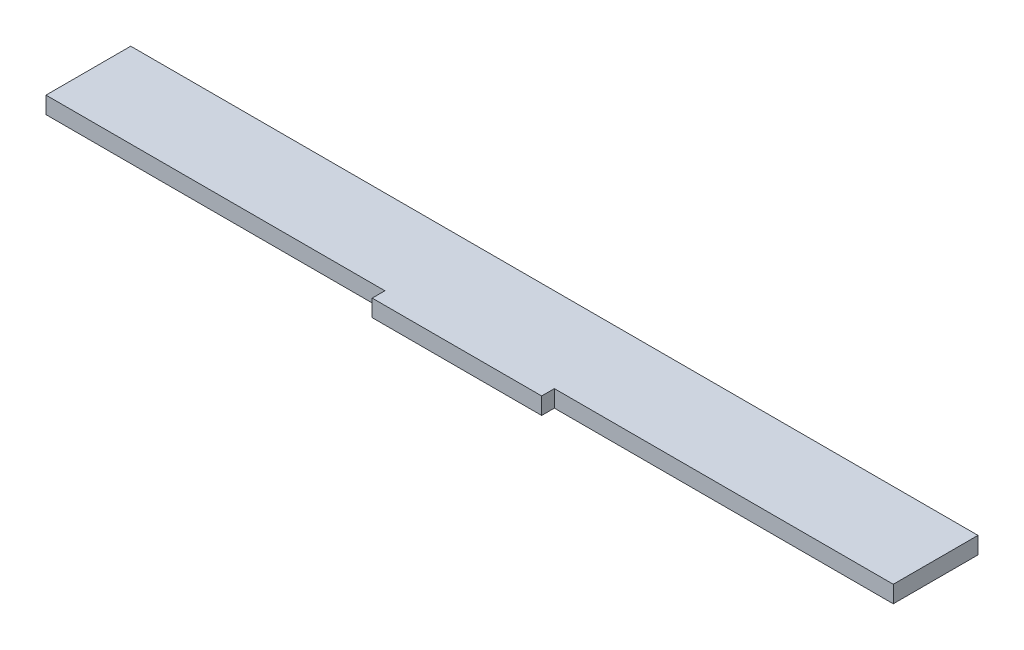
ISO-10303-21;
HEADER;
FILE_DESCRIPTION(('STEP AP214'),'2;1');
FILE_NAME('part.step','',(''),(''),'','','');
FILE_SCHEMA(('AUTOMOTIVE_DESIGN { 1 0 10303 214 1 1 1 1 }'));
ENDSEC;
DATA;
#1=APPLICATION_CONTEXT('core data for automotive mechanical design processes');
#2=APPLICATION_PROTOCOL_DEFINITION('international standard','automotive_design',2000,#1);
#3=PRODUCT_CONTEXT('',#1,'mechanical');
#4=PRODUCT('Part','Part','',(#3));
#5=PRODUCT_RELATED_PRODUCT_CATEGORY('part','',(#4));
#6=PRODUCT_DEFINITION_FORMATION('','',#4);
#7=PRODUCT_DEFINITION_CONTEXT('part definition',#1,'design');
#8=PRODUCT_DEFINITION('design','',#6,#7);
#9=PRODUCT_DEFINITION_SHAPE('','',#8);
#10=(LENGTH_UNIT() NAMED_UNIT(*) SI_UNIT(.MILLI.,.METRE.));
#11=(NAMED_UNIT(*) PLANE_ANGLE_UNIT() SI_UNIT($,.RADIAN.));
#12=(NAMED_UNIT(*) SI_UNIT($,.STERADIAN.) SOLID_ANGLE_UNIT());
#13=UNCERTAINTY_MEASURE_WITH_UNIT(LENGTH_MEASURE(1.E-05),#10,'distance_accuracy_value','');
#14=(GEOMETRIC_REPRESENTATION_CONTEXT(3) GLOBAL_UNCERTAINTY_ASSIGNED_CONTEXT((#13)) GLOBAL_UNIT_ASSIGNED_CONTEXT((#10,
#11,#12)) REPRESENTATION_CONTEXT('',''));
#15=CARTESIAN_POINT('',(0.,0.,0.));
#16=DIRECTION('',(0.,0.,1.));
#17=DIRECTION('',(1.,0.,0.));
#18=AXIS2_PLACEMENT_3D('',#15,#16,#17);
#19=CARTESIAN_POINT('',(0.,4.,-10.));
#20=DIRECTION('',(0.,0.,-1.));
#21=DIRECTION('',(-1.,0.,0.));
#22=AXIS2_PLACEMENT_3D('',#19,#20,#21);
#23=PLANE('',#22);
#24=DIRECTION('',(1.,0.,0.));
#25=VECTOR('',#24,1.);
#26=CARTESIAN_POINT('',(0.,0.,-10.));
#27=LINE('',#26,#25);
#28=CARTESIAN_POINT('',(-100.,0.,-9.99999999999999));
#29=VERTEX_POINT('',#28);
#30=CARTESIAN_POINT('',(100.,0.,-10.));
#31=VERTEX_POINT('',#30);
#32=EDGE_CURVE('E157',#29,#31,#27,.T.);
#33=ORIENTED_EDGE('',*,*,#32,.F.);
#34=DIRECTION('',(0.,-1.,0.));
#35=VECTOR('',#34,1.);
#36=CARTESIAN_POINT('',(-100.,4.,-9.99999999999999));
#37=LINE('',#36,#35);
#38=CARTESIAN_POINT('',(-100.,4.,-9.99999999999999));
#39=VERTEX_POINT('',#38);
#40=EDGE_CURVE('E134',#39,#29,#37,.T.);
#41=ORIENTED_EDGE('',*,*,#40,.F.);
#42=DIRECTION('',(1.,0.,0.));
#43=VECTOR('',#42,1.);
#44=CARTESIAN_POINT('',(0.,4.,-10.));
#45=LINE('',#44,#43);
#46=CARTESIAN_POINT('',(100.,4.,-10.));
#47=VERTEX_POINT('',#46);
#48=EDGE_CURVE('E200',#39,#47,#45,.T.);
#49=ORIENTED_EDGE('',*,*,#48,.T.);
#50=DIRECTION('',(0.,-1.,0.));
#51=VECTOR('',#50,1.);
#52=CARTESIAN_POINT('',(100.,4.,-10.));
#53=LINE('',#52,#51);
#54=EDGE_CURVE('E127',#47,#31,#53,.T.);
#55=ORIENTED_EDGE('',*,*,#54,.T.);
#56=EDGE_LOOP('',(#33,#41,#49,#55));
#57=FACE_BOUND('',#56,.T.);
#58=ADVANCED_FACE('F59',(#57),#23,.T.);
#59=CARTESIAN_POINT('',(-100.,4.,0.));
#60=DIRECTION('',(-1.,0.,0.));
#61=DIRECTION('',(0.,0.,1.));
#62=AXIS2_PLACEMENT_3D('',#59,#60,#61);
#63=PLANE('',#62);
#64=DIRECTION('',(0.,0.,-1.));
#65=VECTOR('',#64,1.);
#66=CARTESIAN_POINT('',(-100.,0.,0.));
#67=LINE('',#66,#65);
#68=CARTESIAN_POINT('',(-100.,0.,10.));
#69=VERTEX_POINT('',#68);
#70=EDGE_CURVE('E165',#69,#29,#67,.T.);
#71=ORIENTED_EDGE('',*,*,#70,.F.);
#72=DIRECTION('',(0.,-1.,0.));
#73=VECTOR('',#72,1.);
#74=CARTESIAN_POINT('',(-100.,4.,10.));
#75=LINE('',#74,#73);
#76=CARTESIAN_POINT('',(-100.,4.,10.));
#77=VERTEX_POINT('',#76);
#78=EDGE_CURVE('E154',#77,#69,#75,.T.);
#79=ORIENTED_EDGE('',*,*,#78,.F.);
#80=DIRECTION('',(0.,0.,-1.));
#81=VECTOR('',#80,1.);
#82=CARTESIAN_POINT('',(-100.,4.,0.));
#83=LINE('',#82,#81);
#84=EDGE_CURVE('E160',#77,#39,#83,.T.);
#85=ORIENTED_EDGE('',*,*,#84,.T.);
#86=ORIENTED_EDGE('',*,*,#40,.T.);
#87=EDGE_LOOP('',(#71,#79,#85,#86));
#88=FACE_BOUND('',#87,.T.);
#89=ADVANCED_FACE('F174',(#88),#63,.T.);
#90=CARTESIAN_POINT('',(100.,4.,0.));
#91=DIRECTION('',(-1.,0.,0.));
#92=DIRECTION('',(0.,0.,1.));
#93=AXIS2_PLACEMENT_3D('',#90,#91,#92);
#94=PLANE('',#93);
#95=DIRECTION('',(0.,0.,-1.));
#96=VECTOR('',#95,1.);
#97=CARTESIAN_POINT('',(100.,0.,0.));
#98=LINE('',#97,#96);
#99=CARTESIAN_POINT('',(100.,0.,9.99999999999998));
#100=VERTEX_POINT('',#99);
#101=EDGE_CURVE('E155',#100,#31,#98,.T.);
#102=ORIENTED_EDGE('',*,*,#101,.T.);
#103=ORIENTED_EDGE('',*,*,#54,.F.);
#104=DIRECTION('',(0.,0.,-1.));
#105=VECTOR('',#104,1.);
#106=CARTESIAN_POINT('',(100.,4.,0.));
#107=LINE('',#106,#105);
#108=CARTESIAN_POINT('',(100.,4.,9.99999999999998));
#109=VERTEX_POINT('',#108);
#110=EDGE_CURVE('E197',#109,#47,#107,.T.);
#111=ORIENTED_EDGE('',*,*,#110,.F.);
#112=DIRECTION('',(0.,-1.,0.));
#113=VECTOR('',#112,1.);
#114=CARTESIAN_POINT('',(100.,4.,9.99999999999998));
#115=LINE('',#114,#113);
#116=EDGE_CURVE('E123',#109,#100,#115,.T.);
#117=ORIENTED_EDGE('',*,*,#116,.T.);
#118=EDGE_LOOP('',(#102,#103,#111,#117));
#119=FACE_BOUND('',#118,.T.);
#120=ADVANCED_FACE('F202',(#119),#94,.F.);
#121=CARTESIAN_POINT('',(0.,0.,0.));
#122=DIRECTION('',(0.,1.,0.));
#123=DIRECTION('',(0.,0.,1.));
#124=AXIS2_PLACEMENT_3D('',#121,#122,#123);
#125=PLANE('',#124);
#126=DIRECTION('',(1.,0.,0.));
#127=VECTOR('',#126,1.);
#128=CARTESIAN_POINT('',(0.,0.,9.99999999999999));
#129=LINE('',#128,#127);
#130=CARTESIAN_POINT('',(-20.,0.,10.));
#131=VERTEX_POINT('',#130);
#132=EDGE_CURVE('E145',#69,#131,#129,.T.);
#133=ORIENTED_EDGE('',*,*,#132,.F.);
#134=ORIENTED_EDGE('',*,*,#70,.T.);
#135=ORIENTED_EDGE('',*,*,#32,.T.);
#136=ORIENTED_EDGE('',*,*,#101,.F.);
#137=CARTESIAN_POINT('',(20.,0.,9.99999999999999));
#138=VERTEX_POINT('',#137);
#139=EDGE_CURVE('E115',#138,#100,#129,.T.);
#140=ORIENTED_EDGE('',*,*,#139,.F.);
#141=DIRECTION('',(0.,0.,1.));
#142=VECTOR('',#141,1.);
#143=CARTESIAN_POINT('',(20.,0.,9.99999999999999));
#144=LINE('',#143,#142);
#145=CARTESIAN_POINT('',(20.,0.,13.));
#146=VERTEX_POINT('',#145);
#147=EDGE_CURVE('E102',#138,#146,#144,.T.);
#148=ORIENTED_EDGE('',*,*,#147,.T.);
#149=DIRECTION('',(1.,0.,0.));
#150=VECTOR('',#149,1.);
#151=CARTESIAN_POINT('',(-20.,0.,13.));
#152=LINE('',#151,#150);
#153=CARTESIAN_POINT('',(-20.,0.,13.));
#154=VERTEX_POINT('',#153);
#155=EDGE_CURVE('E96',#154,#146,#152,.T.);
#156=ORIENTED_EDGE('',*,*,#155,.F.);
#157=DIRECTION('',(0.,0.,1.));
#158=VECTOR('',#157,1.);
#159=CARTESIAN_POINT('',(-20.,0.,10.));
#160=LINE('',#159,#158);
#161=EDGE_CURVE('E109',#131,#154,#160,.T.);
#162=ORIENTED_EDGE('',*,*,#161,.F.);
#163=EDGE_LOOP('',(#133,#134,#135,#136,#140,#148,#156,#162));
#164=FACE_BOUND('',#163,.T.);
#165=ADVANCED_FACE('F112',(#164),#125,.F.);
#166=CARTESIAN_POINT('',(0.,4.,0.));
#167=DIRECTION('',(0.,1.,0.));
#168=DIRECTION('',(0.,0.,1.));
#169=AXIS2_PLACEMENT_3D('',#166,#167,#168);
#170=PLANE('',#169);
#171=DIRECTION('',(1.,0.,0.));
#172=VECTOR('',#171,1.);
#173=CARTESIAN_POINT('',(0.,4.,9.99999999999999));
#174=LINE('',#173,#172);
#175=CARTESIAN_POINT('',(-20.,4.,10.));
#176=VERTEX_POINT('',#175);
#177=EDGE_CURVE('E196',#77,#176,#174,.T.);
#178=ORIENTED_EDGE('',*,*,#177,.T.);
#179=DIRECTION('',(0.,0.,1.));
#180=VECTOR('',#179,1.);
#181=CARTESIAN_POINT('',(-20.,4.,10.));
#182=LINE('',#181,#180);
#183=CARTESIAN_POINT('',(-20.,4.,13.));
#184=VERTEX_POINT('',#183);
#185=EDGE_CURVE('E116',#176,#184,#182,.T.);
#186=ORIENTED_EDGE('',*,*,#185,.T.);
#187=DIRECTION('',(1.,0.,0.));
#188=VECTOR('',#187,1.);
#189=CARTESIAN_POINT('',(-20.,4.,13.));
#190=LINE('',#189,#188);
#191=CARTESIAN_POINT('',(20.,4.,13.));
#192=VERTEX_POINT('',#191);
#193=EDGE_CURVE('E119',#184,#192,#190,.T.);
#194=ORIENTED_EDGE('',*,*,#193,.T.);
#195=DIRECTION('',(0.,0.,1.));
#196=VECTOR('',#195,1.);
#197=CARTESIAN_POINT('',(20.,4.,9.99999999999999));
#198=LINE('',#197,#196);
#199=CARTESIAN_POINT('',(20.,4.,9.99999999999999));
#200=VERTEX_POINT('',#199);
#201=EDGE_CURVE('E104',#200,#192,#198,.T.);
#202=ORIENTED_EDGE('',*,*,#201,.F.);
#203=EDGE_CURVE('E167',#200,#109,#174,.T.);
#204=ORIENTED_EDGE('',*,*,#203,.T.);
#205=ORIENTED_EDGE('',*,*,#110,.T.);
#206=ORIENTED_EDGE('',*,*,#48,.F.);
#207=ORIENTED_EDGE('',*,*,#84,.F.);
#208=EDGE_LOOP('',(#178,#186,#194,#202,#204,#205,#206,#207));
#209=FACE_BOUND('',#208,.T.);
#210=ADVANCED_FACE('F199',(#209),#170,.T.);
#211=CARTESIAN_POINT('',(0.,4.,9.99999999999999));
#212=DIRECTION('',(0.,0.,-1.));
#213=DIRECTION('',(-1.,0.,0.));
#214=AXIS2_PLACEMENT_3D('',#211,#212,#213);
#215=PLANE('',#214);
#216=ORIENTED_EDGE('',*,*,#203,.F.);
#217=DIRECTION('',(0.,-1.,0.));
#218=VECTOR('',#217,1.);
#219=CARTESIAN_POINT('',(20.,4.,9.99999999999999));
#220=LINE('',#219,#218);
#221=EDGE_CURVE('E69',#200,#138,#220,.T.);
#222=ORIENTED_EDGE('',*,*,#221,.T.);
#223=ORIENTED_EDGE('',*,*,#139,.T.);
#224=ORIENTED_EDGE('',*,*,#116,.F.);
#225=EDGE_LOOP('',(#216,#222,#223,#224));
#226=FACE_BOUND('',#225,.T.);
#227=ADVANCED_FACE('F218',(#226),#215,.F.);
#228=DIRECTION('',(0.,-1.,0.));
#229=VECTOR('',#228,1.);
#230=CARTESIAN_POINT('',(-20.,4.,10.));
#231=LINE('',#230,#229);
#232=EDGE_CURVE('E12',#176,#131,#231,.T.);
#233=ORIENTED_EDGE('',*,*,#232,.F.);
#234=ORIENTED_EDGE('',*,*,#177,.F.);
#235=ORIENTED_EDGE('',*,*,#78,.T.);
#236=ORIENTED_EDGE('',*,*,#132,.T.);
#237=EDGE_LOOP('',(#233,#234,#235,#236));
#238=FACE_BOUND('',#237,.T.);
#239=ADVANCED_FACE('F151',(#238),#215,.F.);
#240=CARTESIAN_POINT('',(-20.,4.,13.));
#241=DIRECTION('',(0.,0.,-1.));
#242=DIRECTION('',(-1.,0.,0.));
#243=AXIS2_PLACEMENT_3D('',#240,#241,#242);
#244=PLANE('',#243);
#245=ORIENTED_EDGE('',*,*,#155,.T.);
#246=DIRECTION('',(0.,-1.,0.));
#247=VECTOR('',#246,1.);
#248=CARTESIAN_POINT('',(20.,4.,13.));
#249=LINE('',#248,#247);
#250=EDGE_CURVE('E100',#192,#146,#249,.T.);
#251=ORIENTED_EDGE('',*,*,#250,.F.);
#252=ORIENTED_EDGE('',*,*,#193,.F.);
#253=DIRECTION('',(0.,-1.,0.));
#254=VECTOR('',#253,1.);
#255=CARTESIAN_POINT('',(-20.,4.,13.));
#256=LINE('',#255,#254);
#257=EDGE_CURVE('E63',#184,#154,#256,.T.);
#258=ORIENTED_EDGE('',*,*,#257,.T.);
#259=EDGE_LOOP('',(#245,#251,#252,#258));
#260=FACE_BOUND('',#259,.T.);
#261=ADVANCED_FACE('F106',(#260),#244,.F.);
#262=CARTESIAN_POINT('',(20.,4.,9.99999999999999));
#263=DIRECTION('',(1.,0.,0.));
#264=DIRECTION('',(0.,0.,-1.));
#265=AXIS2_PLACEMENT_3D('',#262,#263,#264);
#266=PLANE('',#265);
#267=ORIENTED_EDGE('',*,*,#147,.F.);
#268=ORIENTED_EDGE('',*,*,#221,.F.);
#269=ORIENTED_EDGE('',*,*,#201,.T.);
#270=ORIENTED_EDGE('',*,*,#250,.T.);
#271=EDGE_LOOP('',(#267,#268,#269,#270));
#272=FACE_BOUND('',#271,.T.);
#273=ADVANCED_FACE('F101',(#272),#266,.T.);
#274=CARTESIAN_POINT('',(-20.,4.,10.));
#275=DIRECTION('',(1.,0.,0.));
#276=DIRECTION('',(0.,0.,-1.));
#277=AXIS2_PLACEMENT_3D('',#274,#275,#276);
#278=PLANE('',#277);
#279=ORIENTED_EDGE('',*,*,#161,.T.);
#280=ORIENTED_EDGE('',*,*,#257,.F.);
#281=ORIENTED_EDGE('',*,*,#185,.F.);
#282=ORIENTED_EDGE('',*,*,#232,.T.);
#283=EDGE_LOOP('',(#279,#280,#281,#282));
#284=FACE_BOUND('',#283,.T.);
#285=ADVANCED_FACE('F61',(#284),#278,.F.);
#286=CLOSED_SHELL('',(#58,#89,#120,#165,#210,#227,#239,#261,#273,#285));
#287=MANIFOLD_SOLID_BREP('B2',#286);
#288=ADVANCED_BREP_SHAPE_REPRESENTATION('',(#18,#287),#14);
#289=SHAPE_DEFINITION_REPRESENTATION(#9,#288);
ENDSEC;
END-ISO-10303-21;
